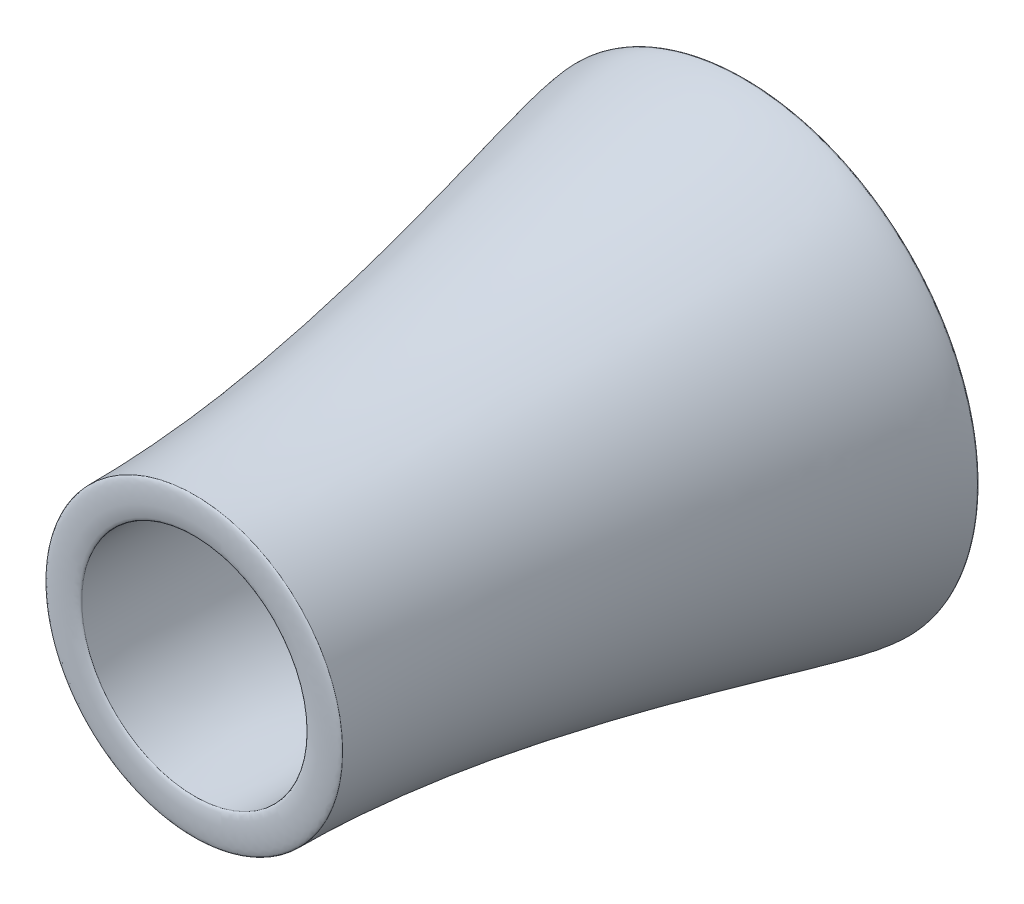
ISO-10303-21;
HEADER;
FILE_DESCRIPTION(('STEP AP214'),'2;1');
FILE_NAME('part.step','',(''),(''),'','','');
FILE_SCHEMA(('AUTOMOTIVE_DESIGN { 1 0 10303 214 1 1 1 1 }'));
ENDSEC;
DATA;
#1=APPLICATION_CONTEXT('core data for automotive mechanical design processes');
#2=APPLICATION_PROTOCOL_DEFINITION('international standard','automotive_design',2000,#1);
#3=PRODUCT_CONTEXT('',#1,'mechanical');
#4=PRODUCT('Part','Part','',(#3));
#5=PRODUCT_RELATED_PRODUCT_CATEGORY('part','',(#4));
#6=PRODUCT_DEFINITION_FORMATION('','',#4);
#7=PRODUCT_DEFINITION_CONTEXT('part definition',#1,'design');
#8=PRODUCT_DEFINITION('design','',#6,#7);
#9=PRODUCT_DEFINITION_SHAPE('','',#8);
#10=(LENGTH_UNIT() NAMED_UNIT(*) SI_UNIT(.MILLI.,.METRE.));
#11=(NAMED_UNIT(*) PLANE_ANGLE_UNIT() SI_UNIT($,.RADIAN.));
#12=(NAMED_UNIT(*) SI_UNIT($,.STERADIAN.) SOLID_ANGLE_UNIT());
#13=UNCERTAINTY_MEASURE_WITH_UNIT(LENGTH_MEASURE(1.E-05),#10,'distance_accuracy_value','');
#14=(GEOMETRIC_REPRESENTATION_CONTEXT(3) GLOBAL_UNCERTAINTY_ASSIGNED_CONTEXT((#13)) GLOBAL_UNIT_ASSIGNED_CONTEXT((#10,
#11,#12)) REPRESENTATION_CONTEXT('',''));
#15=CARTESIAN_POINT('',(0.,0.,0.));
#16=DIRECTION('',(0.,0.,1.));
#17=DIRECTION('',(1.,0.,0.));
#18=AXIS2_PLACEMENT_3D('',#15,#16,#17);
#19=CARTESIAN_POINT('',(-450.143329298044,0.,1095.46249392933));
#20=CARTESIAN_POINT('',(-450.143329298044,0.,1108.16249392933));
#21=CARTESIAN_POINT('',(-342.830536995564,0.,1108.16249392933));
#22=CARTESIAN_POINT('',(-342.830536995564,0.,1095.46249392933));
#23=B_SPLINE_CURVE_WITH_KNOTS('',3,(#19,#20,#21,#22),.UNSPECIFIED.,.F.,.F.,(4,4),(0.,1.),.UNSPECIFIED.);
#24=CARTESIAN_POINT('',(0.,0.,1104.75683012291));
#25=DIRECTION('',(0.,0.,1.));
#26=AXIS1_PLACEMENT('',#24,#25);
#27=SURFACE_OF_REVOLUTION('',#23,#26);
#28=CARTESIAN_POINT('',(0.,0.,1095.46249392933));
#29=DIRECTION('',(0.,0.,1.));
#30=DIRECTION('',(1.,0.,0.));
#31=AXIS2_PLACEMENT_3D('',#28,#29,#30);
#32=CIRCLE('',#31,342.830536995564);
#33=CARTESIAN_POINT('',(342.830536995564,0.,1095.46249392933));
#34=VERTEX_POINT('',#33);
#35=EDGE_CURVE('E47',#34,#34,#32,.T.);
#36=ORIENTED_EDGE('',*,*,#35,.F.);
#37=EDGE_LOOP('',(#36));
#38=FACE_BOUND('',#37,.T.);
#39=CARTESIAN_POINT('',(0.,0.,1095.46249392933));
#40=DIRECTION('',(0.,0.,1.));
#41=DIRECTION('',(1.,0.,0.));
#42=AXIS2_PLACEMENT_3D('',#39,#40,#41);
#43=CIRCLE('',#42,450.143329298044);
#44=CARTESIAN_POINT('',(450.143329298044,0.,1095.46249392933));
#45=VERTEX_POINT('',#44);
#46=EDGE_CURVE('E11',#45,#45,#43,.T.);
#47=ORIENTED_EDGE('',*,*,#46,.T.);
#48=EDGE_LOOP('',(#47));
#49=FACE_BOUND('',#48,.T.);
#50=ADVANCED_FACE('F40',(#38,#49),#27,.T.);
#51=CARTESIAN_POINT('',(-450.143329298044,0.,1095.46249392933));
#52=DIRECTION('',(0.,0.,1.));
#53=DIRECTION('',(1.,0.,0.));
#54=AXIS2_PLACEMENT_3D('',#51,#52,#53);
#55=PLANE('',#54);
#56=ORIENTED_EDGE('',*,*,#46,.F.);
#57=EDGE_LOOP('',(#56));
#58=FACE_BOUND('',#57,.T.);
#59=ORIENTED_EDGE('',*,*,#35,.T.);
#60=EDGE_LOOP('',(#59));
#61=FACE_BOUND('',#60,.T.);
#62=ADVANCED_FACE('F59',(#58,#61),#55,.F.);
#63=CLOSED_SHELL('',(#50,#62));
#64=MANIFOLD_SOLID_BREP('B2',#63);
#65=CARTESIAN_POINT('',(-603.463057220694,0.,-570.808492492293));
#66=CARTESIAN_POINT('',(-603.463057220694,0.,-587.741825825626));
#67=CARTESIAN_POINT('',(-711.609923736489,0.,-587.741825825626));
#68=CARTESIAN_POINT('',(-711.609923736489,0.,-570.808492492293));
#69=B_SPLINE_CURVE_WITH_KNOTS('',3,(#65,#66,#67,#68),.UNSPECIFIED.,.F.,.F.,(4,4),(0.,1.),.UNSPECIFIED.);
#70=CARTESIAN_POINT('',(0.,0.,99.6847843209707));
#71=DIRECTION('',(0.,0.,1.));
#72=AXIS1_PLACEMENT('',#70,#71);
#73=SURFACE_OF_REVOLUTION('',#69,#72);
#74=CARTESIAN_POINT('',(0.,0.,-570.808492492293));
#75=DIRECTION('',(0.,0.,1.));
#76=DIRECTION('',(1.,0.,0.));
#77=AXIS2_PLACEMENT_3D('',#74,#75,#76);
#78=CIRCLE('',#77,711.609923736489);
#79=CARTESIAN_POINT('',(711.609923736489,0.,-570.808492492293));
#80=VERTEX_POINT('',#79);
#81=EDGE_CURVE('E39',#80,#80,#78,.T.);
#82=ORIENTED_EDGE('',*,*,#81,.F.);
#83=EDGE_LOOP('',(#82));
#84=FACE_BOUND('',#83,.T.);
#85=CARTESIAN_POINT('',(0.,0.,-570.808492492293));
#86=DIRECTION('',(0.,0.,1.));
#87=DIRECTION('',(1.,0.,0.));
#88=AXIS2_PLACEMENT_3D('',#85,#86,#87);
#89=CIRCLE('',#88,603.463057220694);
#90=CARTESIAN_POINT('',(603.463057220694,0.,-570.808492492293));
#91=VERTEX_POINT('',#90);
#92=EDGE_CURVE('E93',#91,#91,#89,.T.);
#93=ORIENTED_EDGE('',*,*,#92,.T.);
#94=EDGE_LOOP('',(#93));
#95=FACE_BOUND('',#94,.T.);
#96=ADVANCED_FACE('F86',(#84,#95),#73,.T.);
#97=CARTESIAN_POINT('',(-711.609923736489,0.,-570.808492492293));
#98=DIRECTION('',(0.,0.,-1.));
#99=DIRECTION('',(-1.,0.,0.));
#100=AXIS2_PLACEMENT_3D('',#97,#98,#99);
#101=PLANE('',#100);
#102=ORIENTED_EDGE('',*,*,#92,.F.);
#103=EDGE_LOOP('',(#102));
#104=FACE_BOUND('',#103,.T.);
#105=ORIENTED_EDGE('',*,*,#81,.T.);
#106=EDGE_LOOP('',(#105));
#107=FACE_BOUND('',#106,.T.);
#108=ADVANCED_FACE('F106',(#104,#107),#101,.F.);
#109=CLOSED_SHELL('',(#96,#108));
#110=MANIFOLD_SOLID_BREP('B6',#109);
#111=CARTESIAN_POINT('',(-342.830536995564,0.,1095.46249392933));
#112=CARTESIAN_POINT('',(-342.830536995573,0.,806.353873289444));
#113=CARTESIAN_POINT('',(-304.658098036287,0.,485.273482820751));
#114=CARTESIAN_POINT('',(-484.160636641535,0.,-99.1871517173268));
#115=CARTESIAN_POINT('',(-505.66409569652,0.,-359.371165984264));
#116=CARTESIAN_POINT('',(-603.463057220694,0.,-518.172739970279));
#117=CARTESIAN_POINT('',(-603.463057220694,0.,-570.808492492293));
#118=B_SPLINE_CURVE_WITH_KNOTS('',3,(#111,#112,#113,#114,#115,#116,#117),.UNSPECIFIED.,.F.,.F.,
(4,1,1,1,4),(0.,0.515022649097204,0.793493092504956,0.841990827595236,1.),.UNSPECIFIED.);
#119=CARTESIAN_POINT('',(0.,0.,99.6847843209707));
#120=DIRECTION('',(0.,0.,1.));
#121=AXIS1_PLACEMENT('',#119,#120);
#122=SURFACE_OF_REVOLUTION('',#118,#121);
#123=CARTESIAN_POINT('',(0.,0.,-570.808492492293));
#124=DIRECTION('',(0.,0.,1.));
#125=DIRECTION('',(1.,0.,0.));
#126=AXIS2_PLACEMENT_3D('',#123,#124,#125);
#127=CIRCLE('',#126,603.463057220694);
#128=CARTESIAN_POINT('',(603.463057220694,0.,-570.808492492293));
#129=VERTEX_POINT('',#128);
#130=EDGE_CURVE('E140',#129,#129,#127,.T.);
#131=ORIENTED_EDGE('',*,*,#130,.F.);
#132=EDGE_LOOP('',(#131));
#133=FACE_BOUND('',#132,.T.);
#134=CARTESIAN_POINT('',(0.,0.,1095.46249392933));
#135=DIRECTION('',(0.,0.,1.));
#136=DIRECTION('',(1.,0.,0.));
#137=AXIS2_PLACEMENT_3D('',#134,#135,#136);
#138=CIRCLE('',#137,342.830536995564);
#139=CARTESIAN_POINT('',(342.830536995564,0.,1095.46249392933));
#140=VERTEX_POINT('',#139);
#141=EDGE_CURVE('E85',#140,#140,#138,.T.);
#142=ORIENTED_EDGE('',*,*,#141,.T.);
#143=EDGE_LOOP('',(#142));
#144=FACE_BOUND('',#143,.T.);
#145=ADVANCED_FACE('F125',(#133,#144),#122,.T.);
#146=CARTESIAN_POINT('',(-342.830536995564,0.,1095.46249392933));
#147=DIRECTION('',(0.,0.,-1.));
#148=DIRECTION('',(-1.,0.,0.));
#149=AXIS2_PLACEMENT_3D('',#146,#147,#148);
#150=PLANE('',#149);
#151=ORIENTED_EDGE('',*,*,#141,.F.);
#152=EDGE_LOOP('',(#151));
#153=FACE_BOUND('',#152,.T.);
#154=CARTESIAN_POINT('',(0.,0.,1095.46249392933));
#155=DIRECTION('',(0.,0.,1.));
#156=DIRECTION('',(1.,0.,0.));
#157=AXIS2_PLACEMENT_3D('',#154,#155,#156);
#158=CIRCLE('',#157,450.143329298044);
#159=CARTESIAN_POINT('',(450.143329298044,0.,1095.46249392933));
#160=VERTEX_POINT('',#159);
#161=EDGE_CURVE('E132',#160,#160,#158,.T.);
#162=ORIENTED_EDGE('',*,*,#161,.T.);
#163=EDGE_LOOP('',(#162));
#164=FACE_BOUND('',#163,.T.);
#165=ADVANCED_FACE('F159',(#153,#164),#150,.F.);
#166=CARTESIAN_POINT('',(-711.609923736489,0.,-570.808492492293));
#167=CARTESIAN_POINT('',(-711.609923736489,0.,-445.424540116));
#168=CARTESIAN_POINT('',(-450.143329298043,0.,365.153373544101));
#169=CARTESIAN_POINT('',(-450.143329298044,0.,1095.46249392933));
#170=B_SPLINE_CURVE_WITH_KNOTS('',3,(#166,#167,#168,#169),.UNSPECIFIED.,.F.,.F.,(4,4),(0.,1.),.UNSPECIFIED.);
#171=CARTESIAN_POINT('',(0.,0.,99.6847843209707));
#172=DIRECTION('',(0.,0.,1.));
#173=AXIS1_PLACEMENT('',#171,#172);
#174=SURFACE_OF_REVOLUTION('',#170,#173);
#175=ORIENTED_EDGE('',*,*,#161,.F.);
#176=EDGE_LOOP('',(#175));
#177=FACE_BOUND('',#176,.T.);
#178=CARTESIAN_POINT('',(0.,0.,-570.808492492293));
#179=DIRECTION('',(0.,0.,1.));
#180=DIRECTION('',(1.,0.,0.));
#181=AXIS2_PLACEMENT_3D('',#178,#179,#180);
#182=CIRCLE('',#181,711.609923736489);
#183=CARTESIAN_POINT('',(711.609923736489,0.,-570.808492492293));
#184=VERTEX_POINT('',#183);
#185=EDGE_CURVE('E136',#184,#184,#182,.T.);
#186=ORIENTED_EDGE('',*,*,#185,.T.);
#187=EDGE_LOOP('',(#186));
#188=FACE_BOUND('',#187,.T.);
#189=ADVANCED_FACE('F155',(#177,#188),#174,.T.);
#190=CARTESIAN_POINT('',(-603.463057220694,0.,-570.808492492293));
#191=DIRECTION('',(0.,0.,1.));
#192=DIRECTION('',(1.,0.,0.));
#193=AXIS2_PLACEMENT_3D('',#190,#191,#192);
#194=PLANE('',#193);
#195=ORIENTED_EDGE('',*,*,#185,.F.);
#196=EDGE_LOOP('',(#195));
#197=FACE_BOUND('',#196,.T.);
#198=ORIENTED_EDGE('',*,*,#130,.T.);
#199=EDGE_LOOP('',(#198));
#200=FACE_BOUND('',#199,.T.);
#201=ADVANCED_FACE('F158',(#197,#200),#194,.F.);
#202=CLOSED_SHELL('',(#145,#165,#189,#201));
#203=MANIFOLD_SOLID_BREP('B34',#202);
#204=ADVANCED_BREP_SHAPE_REPRESENTATION('',(#18,#64,#110,#203),#14);
#205=SHAPE_DEFINITION_REPRESENTATION(#9,#204);
ENDSEC;
END-ISO-10303-21;
